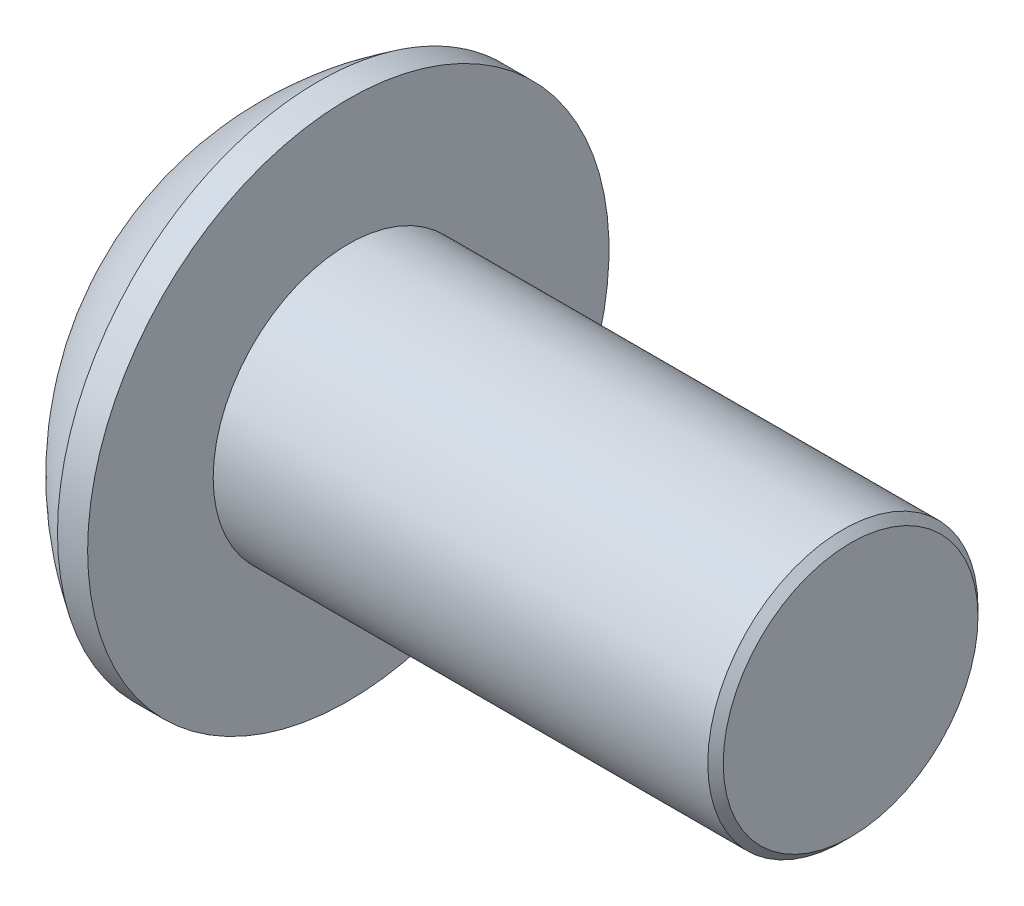
ISO-10303-21;
HEADER;
FILE_DESCRIPTION(('STEP AP214'),'2;1');
FILE_NAME('part.step','',(''),(''),'','','');
FILE_SCHEMA(('AUTOMOTIVE_DESIGN { 1 0 10303 214 1 1 1 1 }'));
ENDSEC;
DATA;
#1=APPLICATION_CONTEXT('core data for automotive mechanical design processes');
#2=APPLICATION_PROTOCOL_DEFINITION('international standard','automotive_design',2000,#1);
#3=PRODUCT_CONTEXT('',#1,'mechanical');
#4=PRODUCT('Part','Part','',(#3));
#5=PRODUCT_RELATED_PRODUCT_CATEGORY('part','',(#4));
#6=PRODUCT_DEFINITION_FORMATION('','',#4);
#7=PRODUCT_DEFINITION_CONTEXT('part definition',#1,'design');
#8=PRODUCT_DEFINITION('design','',#6,#7);
#9=PRODUCT_DEFINITION_SHAPE('','',#8);
#10=(LENGTH_UNIT() NAMED_UNIT(*) SI_UNIT(.MILLI.,.METRE.));
#11=(NAMED_UNIT(*) PLANE_ANGLE_UNIT() SI_UNIT($,.RADIAN.));
#12=(NAMED_UNIT(*) SI_UNIT($,.STERADIAN.) SOLID_ANGLE_UNIT());
#13=UNCERTAINTY_MEASURE_WITH_UNIT(LENGTH_MEASURE(1.E-05),#10,'distance_accuracy_value','');
#14=(GEOMETRIC_REPRESENTATION_CONTEXT(3) GLOBAL_UNCERTAINTY_ASSIGNED_CONTEXT((#13)) GLOBAL_UNIT_ASSIGNED_CONTEXT((#10,
#11,#12)) REPRESENTATION_CONTEXT('',''));
#15=CARTESIAN_POINT('',(0.,0.,0.));
#16=DIRECTION('',(0.,0.,1.));
#17=DIRECTION('',(1.,0.,0.));
#18=AXIS2_PLACEMENT_3D('',#15,#16,#17);
#19=CARTESIAN_POINT('',(1.32080000000034,0.,0.));
#20=DIRECTION('',(-1.,0.,0.));
#21=DIRECTION('',(0.,0.,1.));
#22=AXIS2_PLACEMENT_3D('',#19,#20,#21);
#23=CONICAL_SURFACE('',#22,1.1937999999998,1.04719755119608);
#24=CARTESIAN_POINT('',(2.01004075135902,0.,4.44089209850063E-13));
#25=VERTEX_POINT('',#24);
#26=VERTEX_LOOP('',#25);
#27=FACE_BOUND('',#26,.T.);
#28=CARTESIAN_POINT('',(1.32080000000009,0.,0.));
#29=DIRECTION('',(-1.,0.,0.));
#30=DIRECTION('',(0.,0.,1.));
#31=AXIS2_PLACEMENT_3D('',#28,#29,#30);
#32=CIRCLE('',#31,1.19380000000024);
#33=CARTESIAN_POINT('',(1.32080000000004,-1.03386112703797,0.596900000000061));
#34=VERTEX_POINT('',#33);
#35=CARTESIAN_POINT('',(1.32080000000004,0.,1.19380000000012));
#36=VERTEX_POINT('',#35);
#37=EDGE_CURVE('E19',#34,#36,#32,.T.);
#38=ORIENTED_EDGE('',*,*,#37,.T.);
#39=CARTESIAN_POINT('',(1.32080000000009,0.,0.));
#40=DIRECTION('',(-1.,0.,0.));
#41=DIRECTION('',(0.,0.,1.));
#42=AXIS2_PLACEMENT_3D('',#39,#40,#41);
#43=CIRCLE('',#42,1.19380000000024);
#44=CARTESIAN_POINT('',(1.32080000000004,1.03386112703797,0.59690000000006));
#45=VERTEX_POINT('',#44);
#46=EDGE_CURVE('E147',#36,#45,#43,.T.);
#47=ORIENTED_EDGE('',*,*,#46,.T.);
#48=CARTESIAN_POINT('',(1.32080000000009,0.,0.));
#49=DIRECTION('',(-1.,0.,0.));
#50=DIRECTION('',(0.,0.,1.));
#51=AXIS2_PLACEMENT_3D('',#48,#49,#50);
#52=CIRCLE('',#51,1.19380000000024);
#53=CARTESIAN_POINT('',(1.32080000000004,1.03386112703797,-0.59690000000006));
#54=VERTEX_POINT('',#53);
#55=EDGE_CURVE('E449',#45,#54,#52,.T.);
#56=ORIENTED_EDGE('',*,*,#55,.T.);
#57=CARTESIAN_POINT('',(1.32080000000009,0.,0.));
#58=DIRECTION('',(-1.,0.,0.));
#59=DIRECTION('',(0.,0.,1.));
#60=AXIS2_PLACEMENT_3D('',#57,#58,#59);
#61=CIRCLE('',#60,1.19380000000024);
#62=CARTESIAN_POINT('',(1.32080000000004,1.49457637585666E-12,-1.19380000000012));
#63=VERTEX_POINT('',#62);
#64=EDGE_CURVE('E450',#54,#63,#61,.T.);
#65=ORIENTED_EDGE('',*,*,#64,.T.);
#66=CARTESIAN_POINT('',(1.32080000000009,0.,0.));
#67=DIRECTION('',(-1.,0.,0.));
#68=DIRECTION('',(0.,0.,1.));
#69=AXIS2_PLACEMENT_3D('',#66,#67,#68);
#70=CIRCLE('',#69,1.19380000000024);
#71=CARTESIAN_POINT('',(1.32080000000004,-1.03386112703797,-0.596900000000061));
#72=VERTEX_POINT('',#71);
#73=EDGE_CURVE('E92',#63,#72,#70,.T.);
#74=ORIENTED_EDGE('',*,*,#73,.T.);
#75=CARTESIAN_POINT('',(1.32080000000009,0.,0.));
#76=DIRECTION('',(-1.,0.,0.));
#77=DIRECTION('',(0.,0.,1.));
#78=AXIS2_PLACEMENT_3D('',#75,#76,#77);
#79=CIRCLE('',#78,1.19380000000024);
#80=EDGE_CURVE('E88',#72,#34,#79,.T.);
#81=ORIENTED_EDGE('',*,*,#80,.T.);
#82=EDGE_LOOP('',(#38,#47,#56,#65,#74,#81));
#83=FACE_BOUND('',#82,.T.);
#84=ADVANCED_FACE('F16',(#27,#83),#23,.F.);
#85=CARTESIAN_POINT('',(1.3208,-2.06772225407573,-1.1938));
#86=DIRECTION('',(1.,0.,0.));
#87=DIRECTION('',(0.,0.,-1.));
#88=AXIS2_PLACEMENT_3D('',#85,#86,#87);
#89=PLANE('',#88);
#90=DIRECTION('',(0.,0.5,0.866025403784439));
#91=VECTOR('',#90,1.);
#92=CARTESIAN_POINT('',(1.3208,-1.37848150271715,0.));
#93=LINE('',#92,#91);
#94=CARTESIAN_POINT('',(1.3208,-0.689240751358575,1.1938));
#95=VERTEX_POINT('',#94);
#96=EDGE_CURVE('E100',#95,#34,#93,.F.);
#97=ORIENTED_EDGE('',*,*,#96,.F.);
#98=DIRECTION('',(0.,1.,0.));
#99=VECTOR('',#98,1.);
#100=CARTESIAN_POINT('',(1.3208,-0.689240751358575,1.1938));
#101=LINE('',#100,#99);
#102=EDGE_CURVE('E102',#36,#95,#101,.F.);
#103=ORIENTED_EDGE('',*,*,#102,.F.);
#104=ORIENTED_EDGE('',*,*,#37,.F.);
#105=EDGE_LOOP('',(#97,#103,#104));
#106=FACE_BOUND('',#105,.T.);
#107=ADVANCED_FACE('F98',(#106),#89,.F.);
#108=CARTESIAN_POINT('',(1.3208,-2.06772225407573,-1.1938));
#109=DIRECTION('',(1.,0.,0.));
#110=DIRECTION('',(0.,0.,-1.));
#111=AXIS2_PLACEMENT_3D('',#108,#109,#110);
#112=PLANE('',#111);
#113=DIRECTION('',(0.,-0.5,0.866025403784439));
#114=VECTOR('',#113,1.);
#115=CARTESIAN_POINT('',(1.3208,-0.689240751358575,-1.1938));
#116=LINE('',#115,#114);
#117=CARTESIAN_POINT('',(1.3208,-1.37848150271715,0.));
#118=VERTEX_POINT('',#117);
#119=EDGE_CURVE('E108',#118,#72,#116,.F.);
#120=ORIENTED_EDGE('',*,*,#119,.F.);
#121=DIRECTION('',(0.,0.5,0.866025403784439));
#122=VECTOR('',#121,1.);
#123=CARTESIAN_POINT('',(1.3208,-1.37848150271715,0.));
#124=LINE('',#123,#122);
#125=EDGE_CURVE('E105',#34,#118,#124,.F.);
#126=ORIENTED_EDGE('',*,*,#125,.F.);
#127=ORIENTED_EDGE('',*,*,#80,.F.);
#128=EDGE_LOOP('',(#120,#126,#127));
#129=FACE_BOUND('',#128,.T.);
#130=ADVANCED_FACE('F106',(#129),#112,.F.);
#131=CARTESIAN_POINT('',(1.3208,-2.06772225407573,-1.1938));
#132=DIRECTION('',(1.,0.,0.));
#133=DIRECTION('',(0.,0.,-1.));
#134=AXIS2_PLACEMENT_3D('',#131,#132,#133);
#135=PLANE('',#134);
#136=DIRECTION('',(0.,1.,0.));
#137=VECTOR('',#136,1.);
#138=CARTESIAN_POINT('',(1.3208,0.689240751358575,-1.1938));
#139=LINE('',#138,#137);
#140=CARTESIAN_POINT('',(1.3208,-0.689240751358575,-1.1938));
#141=VERTEX_POINT('',#140);
#142=EDGE_CURVE('E420',#141,#63,#139,.T.);
#143=ORIENTED_EDGE('',*,*,#142,.F.);
#144=DIRECTION('',(0.,-0.5,0.866025403784439));
#145=VECTOR('',#144,1.);
#146=CARTESIAN_POINT('',(1.3208,-0.689240751358575,-1.1938));
#147=LINE('',#146,#145);
#148=EDGE_CURVE('E432',#72,#141,#147,.F.);
#149=ORIENTED_EDGE('',*,*,#148,.F.);
#150=ORIENTED_EDGE('',*,*,#73,.F.);
#151=EDGE_LOOP('',(#143,#149,#150));
#152=FACE_BOUND('',#151,.T.);
#153=ADVANCED_FACE('F190',(#152),#135,.F.);
#154=CARTESIAN_POINT('',(1.3208,-2.06772225407573,-1.1938));
#155=DIRECTION('',(1.,0.,0.));
#156=DIRECTION('',(0.,0.,-1.));
#157=AXIS2_PLACEMENT_3D('',#154,#155,#156);
#158=PLANE('',#157);
#159=DIRECTION('',(0.,-0.499999999999999,-0.866025403784439));
#160=VECTOR('',#159,1.);
#161=CARTESIAN_POINT('',(1.3208,1.37848150271715,0.));
#162=LINE('',#161,#160);
#163=CARTESIAN_POINT('',(1.3208,0.689240751358575,-1.1938));
#164=VERTEX_POINT('',#163);
#165=EDGE_CURVE('E406',#164,#54,#162,.F.);
#166=ORIENTED_EDGE('',*,*,#165,.F.);
#167=DIRECTION('',(0.,1.,0.));
#168=VECTOR('',#167,1.);
#169=CARTESIAN_POINT('',(1.3208,0.689240751358575,-1.1938));
#170=LINE('',#169,#168);
#171=EDGE_CURVE('E417',#63,#164,#170,.T.);
#172=ORIENTED_EDGE('',*,*,#171,.F.);
#173=ORIENTED_EDGE('',*,*,#64,.F.);
#174=EDGE_LOOP('',(#166,#172,#173));
#175=FACE_BOUND('',#174,.T.);
#176=ADVANCED_FACE('F186',(#175),#158,.F.);
#177=CARTESIAN_POINT('',(1.3208,-2.06772225407573,-1.1938));
#178=DIRECTION('',(1.,0.,0.));
#179=DIRECTION('',(0.,0.,-1.));
#180=AXIS2_PLACEMENT_3D('',#177,#178,#179);
#181=PLANE('',#180);
#182=DIRECTION('',(0.,0.499999999999999,-0.866025403784439));
#183=VECTOR('',#182,1.);
#184=CARTESIAN_POINT('',(1.3208,0.689240751358575,1.1938));
#185=LINE('',#184,#183);
#186=CARTESIAN_POINT('',(1.3208,1.37848150271715,0.));
#187=VERTEX_POINT('',#186);
#188=EDGE_CURVE('E385',#187,#45,#185,.F.);
#189=ORIENTED_EDGE('',*,*,#188,.F.);
#190=DIRECTION('',(0.,-0.499999999999999,-0.866025403784439));
#191=VECTOR('',#190,1.);
#192=CARTESIAN_POINT('',(1.3208,1.37848150271715,0.));
#193=LINE('',#192,#191);
#194=EDGE_CURVE('E404',#54,#187,#193,.F.);
#195=ORIENTED_EDGE('',*,*,#194,.F.);
#196=ORIENTED_EDGE('',*,*,#55,.F.);
#197=EDGE_LOOP('',(#189,#195,#196));
#198=FACE_BOUND('',#197,.T.);
#199=ADVANCED_FACE('F182',(#198),#181,.F.);
#200=CARTESIAN_POINT('',(1.3208,-2.06772225407573,-1.1938));
#201=DIRECTION('',(1.,0.,0.));
#202=DIRECTION('',(0.,0.,-1.));
#203=AXIS2_PLACEMENT_3D('',#200,#201,#202);
#204=PLANE('',#203);
#205=DIRECTION('',(0.,1.,0.));
#206=VECTOR('',#205,1.);
#207=CARTESIAN_POINT('',(1.3208,-0.689240751358575,1.1938));
#208=LINE('',#207,#206);
#209=CARTESIAN_POINT('',(1.3208,0.689240751358575,1.1938));
#210=VERTEX_POINT('',#209);
#211=EDGE_CURVE('E117',#210,#36,#208,.F.);
#212=ORIENTED_EDGE('',*,*,#211,.F.);
#213=DIRECTION('',(0.,0.499999999999999,-0.866025403784439));
#214=VECTOR('',#213,1.);
#215=CARTESIAN_POINT('',(1.3208,0.689240751358575,1.1938));
#216=LINE('',#215,#214);
#217=EDGE_CURVE('E388',#45,#210,#216,.F.);
#218=ORIENTED_EDGE('',*,*,#217,.F.);
#219=ORIENTED_EDGE('',*,*,#46,.F.);
#220=EDGE_LOOP('',(#212,#218,#219));
#221=FACE_BOUND('',#220,.T.);
#222=ADVANCED_FACE('F178',(#221),#204,.F.);
#223=CARTESIAN_POINT('',(1.3208,-0.689240751358575,1.1938));
#224=DIRECTION('',(0.,0.,-1.));
#225=DIRECTION('',(0.,1.,0.));
#226=AXIS2_PLACEMENT_3D('',#223,#224,#225);
#227=PLANE('',#226);
#228=DIRECTION('',(0.,1.,0.));
#229=VECTOR('',#228,1.);
#230=CARTESIAN_POINT('',(0.,0.,1.1938));
#231=LINE('',#230,#229);
#232=CARTESIAN_POINT('',(0.,0.689240751358575,1.1938));
#233=VERTEX_POINT('',#232);
#234=CARTESIAN_POINT('',(0.,-0.689240751358575,1.1938));
#235=VERTEX_POINT('',#234);
#236=EDGE_CURVE('E382',#233,#235,#231,.F.);
#237=ORIENTED_EDGE('',*,*,#236,.F.);
#238=DIRECTION('',(1.,0.,0.));
#239=VECTOR('',#238,1.);
#240=CARTESIAN_POINT('',(1.3208,0.689240751358575,1.1938));
#241=LINE('',#240,#239);
#242=EDGE_CURVE('E394',#210,#233,#241,.F.);
#243=ORIENTED_EDGE('',*,*,#242,.F.);
#244=ORIENTED_EDGE('',*,*,#211,.T.);
#245=ORIENTED_EDGE('',*,*,#102,.T.);
#246=DIRECTION('',(1.,0.,0.));
#247=VECTOR('',#246,1.);
#248=CARTESIAN_POINT('',(1.3208,-0.689240751358575,1.1938));
#249=LINE('',#248,#247);
#250=EDGE_CURVE('E111',#235,#95,#249,.T.);
#251=ORIENTED_EDGE('',*,*,#250,.F.);
#252=EDGE_LOOP('',(#237,#243,#244,#245,#251));
#253=FACE_BOUND('',#252,.T.);
#254=ADVANCED_FACE('F175',(#253),#227,.T.);
#255=CARTESIAN_POINT('',(1.3208,-1.37848150271715,0.));
#256=DIRECTION('',(0.,0.866025403784439,-0.5));
#257=DIRECTION('',(0.,0.5,0.866025403784439));
#258=AXIS2_PLACEMENT_3D('',#255,#256,#257);
#259=PLANE('',#258);
#260=DIRECTION('',(0.,-0.5,-0.866025403784439));
#261=VECTOR('',#260,1.);
#262=CARTESIAN_POINT('',(0.,-0.689240751358575,1.1938));
#263=LINE('',#262,#261);
#264=CARTESIAN_POINT('',(0.,-1.37848150271715,0.));
#265=VERTEX_POINT('',#264);
#266=EDGE_CURVE('E379',#235,#265,#263,.T.);
#267=ORIENTED_EDGE('',*,*,#266,.F.);
#268=ORIENTED_EDGE('',*,*,#250,.T.);
#269=ORIENTED_EDGE('',*,*,#96,.T.);
#270=ORIENTED_EDGE('',*,*,#125,.T.);
#271=DIRECTION('',(1.,0.,0.));
#272=VECTOR('',#271,1.);
#273=CARTESIAN_POINT('',(1.3208,-1.37848150271715,0.));
#274=LINE('',#273,#272);
#275=EDGE_CURVE('E429',#265,#118,#274,.T.);
#276=ORIENTED_EDGE('',*,*,#275,.F.);
#277=EDGE_LOOP('',(#267,#268,#269,#270,#276));
#278=FACE_BOUND('',#277,.T.);
#279=ADVANCED_FACE('F115',(#278),#259,.T.);
#280=CARTESIAN_POINT('',(1.3208,-0.689240751358575,-1.1938));
#281=DIRECTION('',(0.,0.866025403784439,0.5));
#282=DIRECTION('',(0.,-0.5,0.866025403784439));
#283=AXIS2_PLACEMENT_3D('',#280,#281,#282);
#284=PLANE('',#283);
#285=DIRECTION('',(0.,0.5,-0.866025403784439));
#286=VECTOR('',#285,1.);
#287=CARTESIAN_POINT('',(0.,-1.37848150271715,0.));
#288=LINE('',#287,#286);
#289=CARTESIAN_POINT('',(0.,-0.689240751358575,-1.1938));
#290=VERTEX_POINT('',#289);
#291=EDGE_CURVE('E376',#265,#290,#288,.T.);
#292=ORIENTED_EDGE('',*,*,#291,.F.);
#293=ORIENTED_EDGE('',*,*,#275,.T.);
#294=ORIENTED_EDGE('',*,*,#119,.T.);
#295=ORIENTED_EDGE('',*,*,#148,.T.);
#296=DIRECTION('',(1.,0.,0.));
#297=VECTOR('',#296,1.);
#298=CARTESIAN_POINT('',(1.3208,-0.689240751358575,-1.1938));
#299=LINE('',#298,#297);
#300=EDGE_CURVE('E414',#290,#141,#299,.T.);
#301=ORIENTED_EDGE('',*,*,#300,.F.);
#302=EDGE_LOOP('',(#292,#293,#294,#295,#301));
#303=FACE_BOUND('',#302,.T.);
#304=ADVANCED_FACE('F168',(#303),#284,.T.);
#305=CARTESIAN_POINT('',(1.3208,0.689240751358575,-1.1938));
#306=DIRECTION('',(0.,0.,1.));
#307=DIRECTION('',(1.,0.,0.));
#308=AXIS2_PLACEMENT_3D('',#305,#306,#307);
#309=PLANE('',#308);
#310=DIRECTION('',(0.,1.,0.));
#311=VECTOR('',#310,1.);
#312=CARTESIAN_POINT('',(0.,0.,-1.1938));
#313=LINE('',#312,#311);
#314=CARTESIAN_POINT('',(0.,0.689240751358575,-1.1938));
#315=VERTEX_POINT('',#314);
#316=EDGE_CURVE('E373',#290,#315,#313,.T.);
#317=ORIENTED_EDGE('',*,*,#316,.F.);
#318=ORIENTED_EDGE('',*,*,#300,.T.);
#319=ORIENTED_EDGE('',*,*,#142,.T.);
#320=ORIENTED_EDGE('',*,*,#171,.T.);
#321=DIRECTION('',(1.,0.,0.));
#322=VECTOR('',#321,1.);
#323=CARTESIAN_POINT('',(1.3208,0.689240751358575,-1.1938));
#324=LINE('',#323,#322);
#325=EDGE_CURVE('E389',#315,#164,#324,.T.);
#326=ORIENTED_EDGE('',*,*,#325,.F.);
#327=EDGE_LOOP('',(#317,#318,#319,#320,#326));
#328=FACE_BOUND('',#327,.T.);
#329=ADVANCED_FACE('F165',(#328),#309,.T.);
#330=CARTESIAN_POINT('',(1.3208,1.37848150271715,0.));
#331=DIRECTION('',(0.,-0.866025403784439,0.499999999999999));
#332=DIRECTION('',(0.,-0.499999999999999,-0.866025403784439));
#333=AXIS2_PLACEMENT_3D('',#330,#331,#332);
#334=PLANE('',#333);
#335=DIRECTION('',(0.,0.499999999999999,0.866025403784439));
#336=VECTOR('',#335,1.);
#337=CARTESIAN_POINT('',(0.,0.689240751358575,-1.1938));
#338=LINE('',#337,#336);
#339=CARTESIAN_POINT('',(0.,1.37848150271715,0.));
#340=VERTEX_POINT('',#339);
#341=EDGE_CURVE('E370',#315,#340,#338,.T.);
#342=ORIENTED_EDGE('',*,*,#341,.F.);
#343=ORIENTED_EDGE('',*,*,#325,.T.);
#344=ORIENTED_EDGE('',*,*,#165,.T.);
#345=ORIENTED_EDGE('',*,*,#194,.T.);
#346=DIRECTION('',(1.,0.,0.));
#347=VECTOR('',#346,1.);
#348=CARTESIAN_POINT('',(1.3208,1.37848150271715,0.));
#349=LINE('',#348,#347);
#350=EDGE_CURVE('E34',#340,#187,#349,.T.);
#351=ORIENTED_EDGE('',*,*,#350,.F.);
#352=EDGE_LOOP('',(#342,#343,#344,#345,#351));
#353=FACE_BOUND('',#352,.T.);
#354=ADVANCED_FACE('F161',(#353),#334,.T.);
#355=CARTESIAN_POINT('',(1.3208,0.689240751358575,1.1938));
#356=DIRECTION('',(0.,-0.866025403784439,-0.499999999999999));
#357=DIRECTION('',(0.,0.499999999999999,-0.866025403784439));
#358=AXIS2_PLACEMENT_3D('',#355,#356,#357);
#359=PLANE('',#358);
#360=DIRECTION('',(0.,-0.499999999999999,0.866025403784439));
#361=VECTOR('',#360,1.);
#362=CARTESIAN_POINT('',(0.,1.37848150271715,0.));
#363=LINE('',#362,#361);
#364=EDGE_CURVE('E146',#340,#233,#363,.T.);
#365=ORIENTED_EDGE('',*,*,#364,.F.);
#366=ORIENTED_EDGE('',*,*,#350,.T.);
#367=ORIENTED_EDGE('',*,*,#188,.T.);
#368=ORIENTED_EDGE('',*,*,#217,.T.);
#369=ORIENTED_EDGE('',*,*,#242,.T.);
#370=EDGE_LOOP('',(#365,#366,#367,#368,#369));
#371=FACE_BOUND('',#370,.T.);
#372=ADVANCED_FACE('F157',(#371),#359,.T.);
#373=CARTESIAN_POINT('',(0.,0.,0.));
#374=DIRECTION('',(-1.,0.,0.));
#375=DIRECTION('',(0.,0.,1.));
#376=AXIS2_PLACEMENT_3D('',#373,#374,#375);
#377=PLANE('',#376);
#378=ORIENTED_EDGE('',*,*,#341,.T.);
#379=ORIENTED_EDGE('',*,*,#364,.T.);
#380=ORIENTED_EDGE('',*,*,#236,.T.);
#381=ORIENTED_EDGE('',*,*,#266,.T.);
#382=ORIENTED_EDGE('',*,*,#291,.T.);
#383=ORIENTED_EDGE('',*,*,#316,.T.);
#384=EDGE_LOOP('',(#378,#379,#380,#381,#382,#383));
#385=FACE_BOUND('',#384,.T.);
#386=CARTESIAN_POINT('',(0.,1.647825,0.));
#387=CARTESIAN_POINT('',(1.63301334336493E-13,1.64781976319874,0.0924902039777531));
#388=CARTESIAN_POINT('',(1.32757099051758E-13,1.63999511633709,0.18514501432637));
#389=CARTESIAN_POINT('',(0.,1.6167119250047,0.322075808080014));
#390=CARTESIAN_POINT('',(-1.58305041826433E-13,1.60700618770234,0.36743553339636));
#391=CARTESIAN_POINT('',(1.58867632387879E-13,1.58380101865852,0.45722093569514));
#392=CARTESIAN_POINT('',(5.685256041377E-13,1.5702985083103,0.501645823115263));
#393=CARTESIAN_POINT('',(9.36225516729674E-13,1.52428156574313,0.632817459278967));
#394=CARTESIAN_POINT('',(0.,1.48621992666366,0.717681965518644));
#395=CARTESIAN_POINT('',(0.,1.39637079695658,0.879809706624016));
#396=CARTESIAN_POINT('',(7.8098507899763E-13,1.34458278455109,0.957072652379993));
#397=CARTESIAN_POINT('',(4.86281509884467E-13,1.25777784714521,1.06558770210237));
#398=CARTESIAN_POINT('',(1.33300448789343E-13,1.22729946114793,1.10054993332365));
#399=CARTESIAN_POINT('',(-1.32738455277453E-13,1.16354004969106,1.16775237388221));
#400=CARTESIAN_POINT('',(0.,1.13026175473033,1.19999517515816));
#401=CARTESIAN_POINT('',(0.,1.02649304340867,1.29236218866442));
#402=CARTESIAN_POINT('',(0.,0.952049986714076,1.34814848277713));
#403=CARTESIAN_POINT('',(0.,0.794895196754067,1.44639825105766));
#404=CARTESIAN_POINT('',(0.,0.712183775431294,1.48886222758992));
#405=CARTESIAN_POINT('',(0.,0.540796624265727,1.55930919813143));
#406=CARTESIAN_POINT('',(0.,0.452120958135283,1.58729234680268));
#407=CARTESIAN_POINT('',(0.,0.271332331080313,1.62797191307413));
#408=CARTESIAN_POINT('',(0.,0.179219351801785,1.64066824903626));
#409=CARTESIAN_POINT('',(0.,-0.00583077027841216,1.65041748705409));
#410=CARTESIAN_POINT('',(0.,-0.0987679130800814,1.64747038910979));
#411=CARTESIAN_POINT('',(0.,-0.282830196388828,1.62601274134436));
#412=CARTESIAN_POINT('',(0.,-0.373955346570021,1.60750227463794));
#413=CARTESIAN_POINT('',(0.,-0.551796068178807,1.55545413364524));
#414=CARTESIAN_POINT('',(0.,-0.638511592498169,1.52191629885844));
#415=CARTESIAN_POINT('',(0.,-0.805120175533157,1.44072378052347));
#416=CARTESIAN_POINT('',(0.,-0.88501297681996,1.39306856461393));
#417=CARTESIAN_POINT('',(0.,-0.997912879588363,1.31211658756413));
#418=CARTESIAN_POINT('',(0.,-1.0343949246834,1.28354906167734));
#419=CARTESIAN_POINT('',(0.,-1.10486279842069,1.22341829303709));
#420=CARTESIAN_POINT('',(0.,-1.13884618403291,1.19185218578117));
#421=CARTESIAN_POINT('',(0.,-1.23657300939909,1.09305906467359));
#422=CARTESIAN_POINT('',(0.,-1.29619288399357,1.02166556658613));
#423=CARTESIAN_POINT('',(0.,-1.40258050817756,0.869876423478034));
#424=CARTESIAN_POINT('',(0.,-1.44934874627766,0.789481120793479));
#425=CARTESIAN_POINT('',(0.,-1.50889406070376,0.663870959313342));
#426=CARTESIAN_POINT('',(0.,-1.52698985473587,0.621110806760429));
#427=CARTESIAN_POINT('',(0.,-1.55950093966665,0.534260776864333));
#428=CARTESIAN_POINT('',(-1.05107454759256E-13,-1.57391920916438,0.49017200820317));
#429=CARTESIAN_POINT('',(2.10313179674657E-13,-1.6114617790958,0.356445777718598));
#430=CARTESIAN_POINT('',(1.14393074710782E-12,-1.62897899568075,0.265126085962908));
#431=CARTESIAN_POINT('',(4.34745916884307E-13,-1.64174347214909,0.144386595969389));
#432=CARTESIAN_POINT('',(1.21687212484297E-13,-1.64402207668916,0.115560405797875));
#433=CARTESIAN_POINT('',(-1.21253531615378E-13,-1.64706365940121,0.05782817572527));
#434=CARTESIAN_POINT('',(0.,-1.64782663757319,0.0289221358241781));
#435=CARTESIAN_POINT('',(1.63526630611819E-13,-1.64781976319875,-0.0924902039777539));
#436=CARTESIAN_POINT('',(1.32928193376509E-13,-1.6399951163371,-0.185145014326371));
#437=CARTESIAN_POINT('',(0.,-1.61671192500471,-0.322075808080014));
#438=CARTESIAN_POINT('',(-1.5850596280799E-13,-1.60700618770235,-0.367435533396361));
#439=CARTESIAN_POINT('',(1.59068716757996E-13,-1.58380101865854,-0.457220935695141));
#440=CARTESIAN_POINT('',(5.69244357076647E-13,-1.57029850831031,-0.501645823115264));
#441=CARTESIAN_POINT('',(9.37389387665157E-13,-1.52428156574314,-0.632817459278967));
#442=CARTESIAN_POINT('',(0.,-1.48621992666367,-0.717681965518644));
#443=CARTESIAN_POINT('',(0.,-1.39637079695659,-0.879809706624016));
#444=CARTESIAN_POINT('',(7.82184361546167E-13,-1.3445827845511,-0.957072652379994));
#445=CARTESIAN_POINT('',(4.8698269374705E-13,-1.25777784714522,-1.06558770210237));
#446=CARTESIAN_POINT('',(1.33453863497426E-13,-1.22729946114795,-1.10054993332365));
#447=CARTESIAN_POINT('',(-1.32891722070652E-13,-1.16354004969107,-1.16775237388221));
#448=CARTESIAN_POINT('',(0.,-1.13026175473034,-1.19999517515816));
#449=CARTESIAN_POINT('',(0.,-1.02649304340868,-1.29236218866442));
#450=CARTESIAN_POINT('',(0.,-0.95204998671409,-1.34814848277713));
#451=CARTESIAN_POINT('',(0.,-0.794895196754081,-1.44639825105766));
#452=CARTESIAN_POINT('',(0.,-0.712183775431308,-1.48886222758992));
#453=CARTESIAN_POINT('',(0.,-0.540796624265741,-1.55930919813143));
#454=CARTESIAN_POINT('',(0.,-0.452120958135296,-1.58729234680268));
#455=CARTESIAN_POINT('',(0.,-0.271332331080326,-1.62797191307413));
#456=CARTESIAN_POINT('',(0.,-0.179219351801799,-1.64066824903626));
#457=CARTESIAN_POINT('',(0.,0.00583077027839795,-1.65041748705409));
#458=CARTESIAN_POINT('',(0.,0.0987679130800671,-1.64747038910979));
#459=CARTESIAN_POINT('',(0.,0.282830196388814,-1.62601274134436));
#460=CARTESIAN_POINT('',(0.,0.373955346570008,-1.60750227463794));
#461=CARTESIAN_POINT('',(0.,0.551796068178794,-1.55545413364524));
#462=CARTESIAN_POINT('',(0.,0.638511592498155,-1.52191629885844));
#463=CARTESIAN_POINT('',(0.,0.805120175533143,-1.44072378052347));
#464=CARTESIAN_POINT('',(0.,0.885012976819946,-1.39306856461393));
#465=CARTESIAN_POINT('',(0.,0.997912879588349,-1.31211658756413));
#466=CARTESIAN_POINT('',(0.,1.03439492468339,-1.28354906167734));
#467=CARTESIAN_POINT('',(0.,1.10486279842068,-1.22341829303709));
#468=CARTESIAN_POINT('',(0.,1.1388461840329,-1.19185218578117));
#469=CARTESIAN_POINT('',(0.,1.23657300939908,-1.09305906467359));
#470=CARTESIAN_POINT('',(0.,1.29619288399356,-1.02166556658613));
#471=CARTESIAN_POINT('',(0.,1.40258050817755,-0.869876423478034));
#472=CARTESIAN_POINT('',(0.,1.44934874627765,-0.789481120793478));
#473=CARTESIAN_POINT('',(0.,1.50889406070374,-0.663870959313341));
#474=CARTESIAN_POINT('',(0.,1.52698985473585,-0.621110806760428));
#475=CARTESIAN_POINT('',(0.,1.55950093966663,-0.534260776864332));
#476=CARTESIAN_POINT('',(-1.05168985037331E-13,1.57391920916437,-0.490172008203169));
#477=CARTESIAN_POINT('',(2.10435917606606E-13,1.61146177909578,-0.356445777718597));
#478=CARTESIAN_POINT('',(1.1439227149816E-12,1.62897899568074,-0.265126085962907));
#479=CARTESIAN_POINT('',(4.34748428569173E-13,1.64174347214908,-0.144386595969389));
#480=CARTESIAN_POINT('',(1.21705808532127E-13,1.64402207668915,-0.115560405797875));
#481=CARTESIAN_POINT('',(-1.21272127663207E-13,1.6470636594012,-0.0578281757252703));
#482=CARTESIAN_POINT('',(0.,1.64782663757318,-0.0289221358241787));
#483=CARTESIAN_POINT('',(0.,1.647825,0.));
#484=B_SPLINE_CURVE_WITH_KNOTS('',3,(#386,#387,#388,#389,#390,#391,#392,#393,#394,#395,#396,
#397,#398,#399,#400,#401,#402,#403,#404,#405,#406,#407,#408,#409,#410,#411,#412,#413,#414,#415,
#416,#417,#418,#419,#420,#421,#422,#423,#424,#425,#426,#427,#428,#429,#430,#431,#432,#433,#434,
#435,#436,#437,#438,#439,#440,#441,#442,#443,#444,#445,#446,#447,#448,#449,#450,#451,#452,#453,
#454,#455,#456,#457,#458,#459,#460,#461,#462,#463,#464,#465,#466,#467,#468,#469,#470,#471,#472,
#473,#474,#475,#476,#477,#478,#479,#480,#481,#482,#483),.UNSPECIFIED.,.T.,.F.,(4,2,2,2,2,2,2,2,
2,2,2,2,2,2,2,2,2,2,2,2,2,2,2,2,2,2,2,2,2,2,2,2,2,2,2,2,2,2,2,2,2,2,2,2,2,2,2,2,4),(0.,
0.277336029422426,0.416368541537111,0.5555141146256,0.833141970294987,1.11078038089036,
1.24978149120748,1.38864858351854,1.66629367015056,1.94392828594775,2.22155993641642,
2.49919306954937,2.77682620268234,3.05445785315102,3.3320924689482,3.60973755557991,
3.74860464789075,3.88760575820768,4.16524416880333,4.44287202447288,4.58201759756161,
4.72105010967663,4.99838613909883,5.08511046196678,5.17183478483478,5.4491708142572,
5.58820332637189,5.72734889946037,6.00497675512976,6.28261516572514,6.42161627604225,
6.56048336835332,6.83812845498533,7.11576307078252,7.3933947212512,7.67102785438415,
7.94866098751711,8.22629263798579,8.50392725378298,8.78157234041468,8.92043943272552,
9.05944054304245,9.3370789536381,9.61470680930765,9.75385238239638,9.8928848945114,
10.1702209239336,10.2569452468015,10.3436695696695),.UNSPECIFIED.);
#485=CARTESIAN_POINT('',(0.,1.647825,0.));
#486=VERTEX_POINT('',#485);
#487=EDGE_CURVE('E139',#486,#486,#484,.T.);
#488=ORIENTED_EDGE('',*,*,#487,.F.);
#489=EDGE_LOOP('',(#488));
#490=FACE_BOUND('',#489,.T.);
#491=ADVANCED_FACE('F153',(#385,#490),#377,.T.);
#492=CARTESIAN_POINT('',(3.50132362607759,0.,0.));
#493=DIRECTION('',(0.,1.,0.));
#494=DIRECTION('',(1.,0.,0.));
#495=AXIS2_PLACEMENT_3D('',#492,#493,#494);
#496=SPHERICAL_SURFACE('',#495,3.86970210289554);
#497=CARTESIAN_POINT('',(1.4732,0.,0.));
#498=DIRECTION('',(-1.,0.,0.));
#499=DIRECTION('',(0.,0.,1.));
#500=AXIS2_PLACEMENT_3D('',#497,#498,#499);
#501=CIRCLE('',#500,3.29565);
#502=CARTESIAN_POINT('',(1.4732,0.,3.29565));
#503=VERTEX_POINT('',#502);
#504=EDGE_CURVE('E136',#503,#503,#501,.F.);
#505=ORIENTED_EDGE('',*,*,#504,.F.);
#506=EDGE_LOOP('',(#505));
#507=FACE_BOUND('',#506,.T.);
#508=ORIENTED_EDGE('',*,*,#487,.T.);
#509=EDGE_LOOP('',(#508));
#510=FACE_BOUND('',#509,.T.);
#511=ADVANCED_FACE('F149',(#507,#510),#496,.T.);
#512=CARTESIAN_POINT('',(8.2042,0.,0.));
#513=DIRECTION('',(-1.,0.,0.));
#514=DIRECTION('',(0.,0.,1.));
#515=AXIS2_PLACEMENT_3D('',#512,#513,#514);
#516=PLANE('',#515);
#517=CARTESIAN_POINT('',(8.20420000002287,0.,0.));
#518=DIRECTION('',(-1.,0.,0.));
#519=DIRECTION('',(0.,0.,1.));
#520=AXIS2_PLACEMENT_3D('',#517,#518,#519);
#521=CIRCLE('',#520,1.61036000002923);
#522=CARTESIAN_POINT('',(8.20420000002287,0.,1.61036000002923));
#523=VERTEX_POINT('',#522);
#524=EDGE_CURVE('E133',#523,#523,#521,.T.);
#525=ORIENTED_EDGE('',*,*,#524,.F.);
#526=EDGE_LOOP('',(#525));
#527=FACE_BOUND('',#526,.T.);
#528=ADVANCED_FACE('F220',(#527),#516,.F.);
#529=CARTESIAN_POINT('',(0.,0.,0.));
#530=DIRECTION('',(-1.,0.,0.));
#531=DIRECTION('',(0.,0.,1.));
#532=AXIS2_PLACEMENT_3D('',#529,#530,#531);
#533=CYLINDRICAL_SURFACE('',#532,3.29565);
#534=ORIENTED_EDGE('',*,*,#504,.T.);
#535=EDGE_LOOP('',(#534));
#536=FACE_BOUND('',#535,.T.);
#537=CARTESIAN_POINT('',(1.8542,0.,0.));
#538=DIRECTION('',(-1.,0.,0.));
#539=DIRECTION('',(0.,0.,1.));
#540=AXIS2_PLACEMENT_3D('',#537,#538,#539);
#541=CIRCLE('',#540,3.29565);
#542=CARTESIAN_POINT('',(1.8542,0.,3.29565));
#543=VERTEX_POINT('',#542);
#544=EDGE_CURVE('E130',#543,#543,#541,.T.);
#545=ORIENTED_EDGE('',*,*,#544,.T.);
#546=EDGE_LOOP('',(#545));
#547=FACE_BOUND('',#546,.T.);
#548=ADVANCED_FACE('F217',(#536,#547),#533,.T.);
#549=CARTESIAN_POINT('',(8.10641000009582,0.,0.));
#550=DIRECTION('',(-1.,0.,0.));
#551=DIRECTION('',(0.,0.,1.));
#552=AXIS2_PLACEMENT_3D('',#549,#550,#551);
#553=CONICAL_SURFACE('',#552,1.70814999989943,0.785398163106808);
#554=CARTESIAN_POINT('',(8.10641000000006,0.,0.));
#555=DIRECTION('',(-1.,0.,0.));
#556=DIRECTION('',(0.,0.,1.));
#557=AXIS2_PLACEMENT_3D('',#554,#555,#556);
#558=CIRCLE('',#557,1.70814999999999);
#559=CARTESIAN_POINT('',(8.10641000000006,0.,1.70814999999999));
#560=VERTEX_POINT('',#559);
#561=EDGE_CURVE('E25',#560,#560,#558,.T.);
#562=ORIENTED_EDGE('',*,*,#561,.F.);
#563=EDGE_LOOP('',(#562));
#564=FACE_BOUND('',#563,.T.);
#565=ORIENTED_EDGE('',*,*,#524,.T.);
#566=EDGE_LOOP('',(#565));
#567=FACE_BOUND('',#566,.T.);
#568=ADVANCED_FACE('F210',(#564,#567),#553,.T.);
#569=CARTESIAN_POINT('',(1.8542,1.70814999999999,0.));
#570=DIRECTION('',(-1.,0.,0.));
#571=DIRECTION('',(0.,0.,1.));
#572=AXIS2_PLACEMENT_3D('',#569,#570,#571);
#573=PLANE('',#572);
#574=CARTESIAN_POINT('',(1.8542,0.,0.));
#575=DIRECTION('',(-1.,0.,0.));
#576=DIRECTION('',(0.,0.,1.));
#577=AXIS2_PLACEMENT_3D('',#574,#575,#576);
#578=CIRCLE('',#577,1.70814999999999);
#579=CARTESIAN_POINT('',(1.8542,0.,1.70814999999999));
#580=VERTEX_POINT('',#579);
#581=EDGE_CURVE('E11',#580,#580,#578,.F.);
#582=ORIENTED_EDGE('',*,*,#581,.F.);
#583=EDGE_LOOP('',(#582));
#584=FACE_BOUND('',#583,.T.);
#585=ORIENTED_EDGE('',*,*,#544,.F.);
#586=EDGE_LOOP('',(#585));
#587=FACE_BOUND('',#586,.T.);
#588=ADVANCED_FACE('F204',(#584,#587),#573,.F.);
#589=CARTESIAN_POINT('',(0.,0.,0.));
#590=DIRECTION('',(-1.,0.,0.));
#591=DIRECTION('',(0.,0.,1.));
#592=AXIS2_PLACEMENT_3D('',#589,#590,#591);
#593=CYLINDRICAL_SURFACE('',#592,1.70814999999999);
#594=ORIENTED_EDGE('',*,*,#581,.T.);
#595=EDGE_LOOP('',(#594));
#596=FACE_BOUND('',#595,.T.);
#597=ORIENTED_EDGE('',*,*,#561,.T.);
#598=EDGE_LOOP('',(#597));
#599=FACE_BOUND('',#598,.T.);
#600=ADVANCED_FACE('F202',(#596,#599),#593,.T.);
#601=CLOSED_SHELL('',(#84,#107,#130,#153,#176,#199,#222,#254,#279,#304,#329,#354,#372,#491,#511,
#528,#548,#568,#588,#600));
#602=MANIFOLD_SOLID_BREP('B1',#601);
#603=ADVANCED_BREP_SHAPE_REPRESENTATION('',(#18,#602),#14);
#604=SHAPE_DEFINITION_REPRESENTATION(#9,#603);
ENDSEC;
END-ISO-10303-21;
